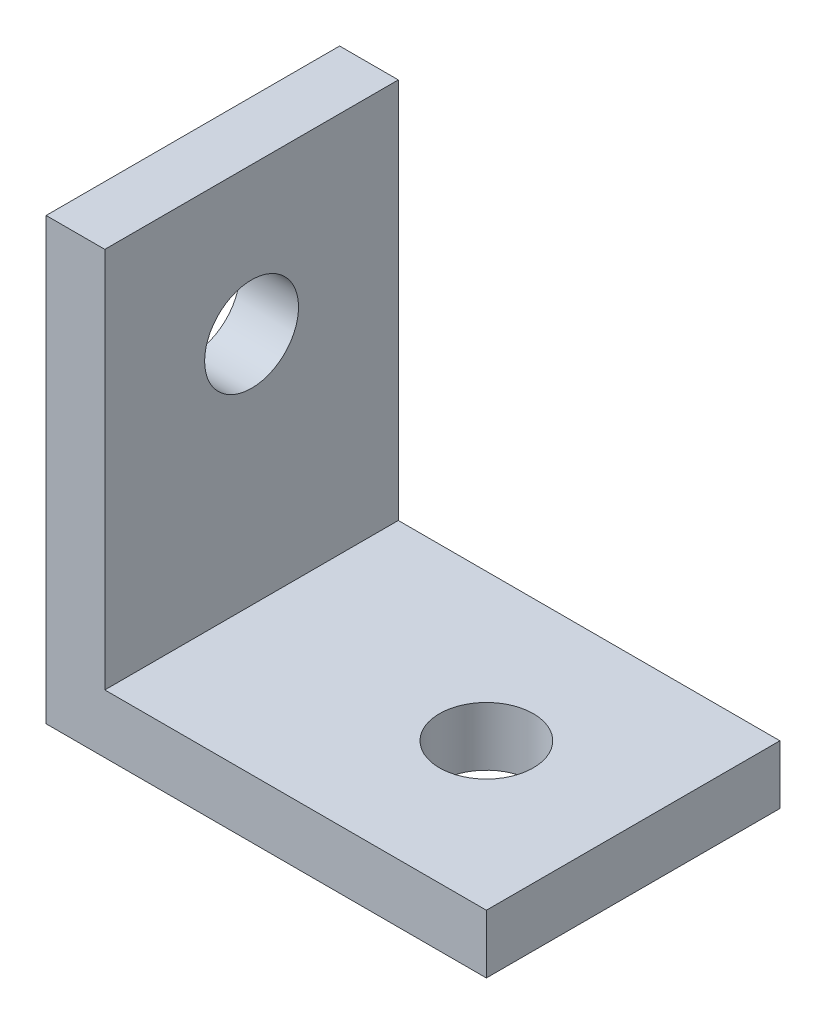
ISO-10303-21;
HEADER;
FILE_DESCRIPTION(('STEP AP214'),'2;1');
FILE_NAME('part.step','',(''),(''),'','','');
FILE_SCHEMA(('AUTOMOTIVE_DESIGN { 1 0 10303 214 1 1 1 1 }'));
ENDSEC;
DATA;
#1=APPLICATION_CONTEXT('core data for automotive mechanical design processes');
#2=APPLICATION_PROTOCOL_DEFINITION('international standard','automotive_design',2000,#1);
#3=PRODUCT_CONTEXT('',#1,'mechanical');
#4=PRODUCT('Part','Part','',(#3));
#5=PRODUCT_RELATED_PRODUCT_CATEGORY('part','',(#4));
#6=PRODUCT_DEFINITION_FORMATION('','',#4);
#7=PRODUCT_DEFINITION_CONTEXT('part definition',#1,'design');
#8=PRODUCT_DEFINITION('design','',#6,#7);
#9=PRODUCT_DEFINITION_SHAPE('','',#8);
#10=(LENGTH_UNIT() NAMED_UNIT(*) SI_UNIT(.MILLI.,.METRE.));
#11=(NAMED_UNIT(*) PLANE_ANGLE_UNIT() SI_UNIT($,.RADIAN.));
#12=(NAMED_UNIT(*) SI_UNIT($,.STERADIAN.) SOLID_ANGLE_UNIT());
#13=UNCERTAINTY_MEASURE_WITH_UNIT(LENGTH_MEASURE(1.E-05),#10,'distance_accuracy_value','');
#14=(GEOMETRIC_REPRESENTATION_CONTEXT(3) GLOBAL_UNCERTAINTY_ASSIGNED_CONTEXT((#13)) GLOBAL_UNIT_ASSIGNED_CONTEXT((#10,
#11,#12)) REPRESENTATION_CONTEXT('',''));
#15=CARTESIAN_POINT('',(0.,0.,0.));
#16=DIRECTION('',(0.,0.,1.));
#17=DIRECTION('',(1.,0.,0.));
#18=AXIS2_PLACEMENT_3D('',#15,#16,#17);
#19=CARTESIAN_POINT('',(15.,0.,5.));
#20=DIRECTION('',(0.,1.,0.));
#21=DIRECTION('',(-1.,0.,0.));
#22=AXIS2_PLACEMENT_3D('',#19,#20,#21);
#23=PLANE('',#22);
#24=CARTESIAN_POINT('',(10.,0.,0.));
#25=DIRECTION('',(0.,-1.,0.));
#26=DIRECTION('',(0.,0.,-1.));
#27=AXIS2_PLACEMENT_3D('',#24,#25,#26);
#28=CIRCLE('',#27,1.59999999999999);
#29=CARTESIAN_POINT('',(10.,0.,-1.59999999999999));
#30=VERTEX_POINT('',#29);
#31=EDGE_CURVE('E162',#30,#30,#28,.T.);
#32=ORIENTED_EDGE('',*,*,#31,.F.);
#33=EDGE_LOOP('',(#32));
#34=FACE_BOUND('',#33,.T.);
#35=DIRECTION('',(1.,0.,0.));
#36=VECTOR('',#35,1.);
#37=CARTESIAN_POINT('',(15.,0.,-5.));
#38=LINE('',#37,#36);
#39=CARTESIAN_POINT('',(0.,0.,-5.));
#40=VERTEX_POINT('',#39);
#41=CARTESIAN_POINT('',(15.,0.,-5.));
#42=VERTEX_POINT('',#41);
#43=EDGE_CURVE('E118',#40,#42,#38,.T.);
#44=ORIENTED_EDGE('',*,*,#43,.T.);
#45=DIRECTION('',(0.,0.,-1.));
#46=VECTOR('',#45,1.);
#47=CARTESIAN_POINT('',(15.,0.,5.));
#48=LINE('',#47,#46);
#49=CARTESIAN_POINT('',(15.,0.,5.));
#50=VERTEX_POINT('',#49);
#51=EDGE_CURVE('E11',#50,#42,#48,.T.);
#52=ORIENTED_EDGE('',*,*,#51,.F.);
#53=DIRECTION('',(1.,0.,0.));
#54=VECTOR('',#53,1.);
#55=CARTESIAN_POINT('',(15.,0.,5.));
#56=LINE('',#55,#54);
#57=CARTESIAN_POINT('',(0.,0.,5.));
#58=VERTEX_POINT('',#57);
#59=EDGE_CURVE('E129',#58,#50,#56,.T.);
#60=ORIENTED_EDGE('',*,*,#59,.F.);
#61=DIRECTION('',(0.,0.,-1.));
#62=VECTOR('',#61,1.);
#63=CARTESIAN_POINT('',(0.,0.,5.));
#64=LINE('',#63,#62);
#65=EDGE_CURVE('E114',#58,#40,#64,.T.);
#66=ORIENTED_EDGE('',*,*,#65,.T.);
#67=EDGE_LOOP('',(#44,#52,#60,#66));
#68=FACE_BOUND('',#67,.T.);
#69=ADVANCED_FACE('F34',(#34,#68),#23,.F.);
#70=CARTESIAN_POINT('',(15.,2.,5.));
#71=DIRECTION('',(-1.,0.,0.));
#72=DIRECTION('',(0.,0.,1.));
#73=AXIS2_PLACEMENT_3D('',#70,#71,#72);
#74=PLANE('',#73);
#75=DIRECTION('',(0.,1.,0.));
#76=VECTOR('',#75,1.);
#77=CARTESIAN_POINT('',(15.,2.,-5.));
#78=LINE('',#77,#76);
#79=CARTESIAN_POINT('',(15.,2.,-5.));
#80=VERTEX_POINT('',#79);
#81=EDGE_CURVE('E121',#42,#80,#78,.T.);
#82=ORIENTED_EDGE('',*,*,#81,.T.);
#83=DIRECTION('',(0.,0.,-1.));
#84=VECTOR('',#83,1.);
#85=CARTESIAN_POINT('',(15.,2.,5.));
#86=LINE('',#85,#84);
#87=CARTESIAN_POINT('',(15.,2.,5.));
#88=VERTEX_POINT('',#87);
#89=EDGE_CURVE('E42',#88,#80,#86,.T.);
#90=ORIENTED_EDGE('',*,*,#89,.F.);
#91=DIRECTION('',(0.,1.,0.));
#92=VECTOR('',#91,1.);
#93=CARTESIAN_POINT('',(15.,2.,5.));
#94=LINE('',#93,#92);
#95=EDGE_CURVE('E87',#50,#88,#94,.T.);
#96=ORIENTED_EDGE('',*,*,#95,.F.);
#97=ORIENTED_EDGE('',*,*,#51,.T.);
#98=EDGE_LOOP('',(#82,#90,#96,#97));
#99=FACE_BOUND('',#98,.T.);
#100=ADVANCED_FACE('F155',(#99),#74,.F.);
#101=CARTESIAN_POINT('',(2.,2.,5.));
#102=DIRECTION('',(0.,-1.,0.));
#103=DIRECTION('',(0.,0.,-1.));
#104=AXIS2_PLACEMENT_3D('',#101,#102,#103);
#105=PLANE('',#104);
#106=CARTESIAN_POINT('',(10.,2.,0.));
#107=DIRECTION('',(0.,-1.,0.));
#108=DIRECTION('',(0.,0.,-1.));
#109=AXIS2_PLACEMENT_3D('',#106,#107,#108);
#110=CIRCLE('',#109,1.59999999999999);
#111=CARTESIAN_POINT('',(10.,2.,-1.59999999999999));
#112=VERTEX_POINT('',#111);
#113=EDGE_CURVE('E122',#112,#112,#110,.T.);
#114=ORIENTED_EDGE('',*,*,#113,.T.);
#115=EDGE_LOOP('',(#114));
#116=FACE_BOUND('',#115,.T.);
#117=DIRECTION('',(-1.,0.,0.));
#118=VECTOR('',#117,1.);
#119=CARTESIAN_POINT('',(2.,2.,-5.));
#120=LINE('',#119,#118);
#121=CARTESIAN_POINT('',(2.,2.,-5.));
#122=VERTEX_POINT('',#121);
#123=EDGE_CURVE('E124',#80,#122,#120,.T.);
#124=ORIENTED_EDGE('',*,*,#123,.T.);
#125=DIRECTION('',(0.,0.,-1.));
#126=VECTOR('',#125,1.);
#127=CARTESIAN_POINT('',(2.,2.,5.));
#128=LINE('',#127,#126);
#129=CARTESIAN_POINT('',(2.,2.,5.));
#130=VERTEX_POINT('',#129);
#131=EDGE_CURVE('E109',#130,#122,#128,.T.);
#132=ORIENTED_EDGE('',*,*,#131,.F.);
#133=DIRECTION('',(-1.,0.,0.));
#134=VECTOR('',#133,1.);
#135=CARTESIAN_POINT('',(2.,2.,5.));
#136=LINE('',#135,#134);
#137=EDGE_CURVE('E100',#88,#130,#136,.T.);
#138=ORIENTED_EDGE('',*,*,#137,.F.);
#139=ORIENTED_EDGE('',*,*,#89,.T.);
#140=EDGE_LOOP('',(#124,#132,#138,#139));
#141=FACE_BOUND('',#140,.T.);
#142=ADVANCED_FACE('F135',(#116,#141),#105,.F.);
#143=CARTESIAN_POINT('',(2.,15.,5.));
#144=DIRECTION('',(-1.,0.,0.));
#145=DIRECTION('',(0.,-1.,0.));
#146=AXIS2_PLACEMENT_3D('',#143,#144,#145);
#147=PLANE('',#146);
#148=CARTESIAN_POINT('',(2.,10.,0.));
#149=DIRECTION('',(-1.,0.,0.));
#150=DIRECTION('',(0.,-1.,0.));
#151=AXIS2_PLACEMENT_3D('',#148,#149,#150);
#152=CIRCLE('',#151,1.59999999999999);
#153=CARTESIAN_POINT('',(2.,8.40000000000001,0.));
#154=VERTEX_POINT('',#153);
#155=EDGE_CURVE('E164',#154,#154,#152,.T.);
#156=ORIENTED_EDGE('',*,*,#155,.T.);
#157=EDGE_LOOP('',(#156));
#158=FACE_BOUND('',#157,.T.);
#159=DIRECTION('',(0.,1.,0.));
#160=VECTOR('',#159,1.);
#161=CARTESIAN_POINT('',(2.,15.,-5.));
#162=LINE('',#161,#160);
#163=CARTESIAN_POINT('',(2.,15.,-5.));
#164=VERTEX_POINT('',#163);
#165=EDGE_CURVE('E108',#122,#164,#162,.T.);
#166=ORIENTED_EDGE('',*,*,#165,.T.);
#167=DIRECTION('',(0.,0.,-1.));
#168=VECTOR('',#167,1.);
#169=CARTESIAN_POINT('',(2.,15.,5.));
#170=LINE('',#169,#168);
#171=CARTESIAN_POINT('',(2.,15.,5.));
#172=VERTEX_POINT('',#171);
#173=EDGE_CURVE('E105',#172,#164,#170,.T.);
#174=ORIENTED_EDGE('',*,*,#173,.F.);
#175=DIRECTION('',(0.,1.,0.));
#176=VECTOR('',#175,1.);
#177=CARTESIAN_POINT('',(2.,15.,5.));
#178=LINE('',#177,#176);
#179=EDGE_CURVE('E94',#130,#172,#178,.T.);
#180=ORIENTED_EDGE('',*,*,#179,.F.);
#181=ORIENTED_EDGE('',*,*,#131,.T.);
#182=EDGE_LOOP('',(#166,#174,#180,#181));
#183=FACE_BOUND('',#182,.T.);
#184=ADVANCED_FACE('F106',(#158,#183),#147,.F.);
#185=CARTESIAN_POINT('',(0.,15.,5.));
#186=DIRECTION('',(0.,-1.,0.));
#187=DIRECTION('',(0.,0.,-1.));
#188=AXIS2_PLACEMENT_3D('',#185,#186,#187);
#189=PLANE('',#188);
#190=DIRECTION('',(-1.,0.,0.));
#191=VECTOR('',#190,1.);
#192=CARTESIAN_POINT('',(0.,15.,-5.));
#193=LINE('',#192,#191);
#194=CARTESIAN_POINT('',(0.,15.,-5.));
#195=VERTEX_POINT('',#194);
#196=EDGE_CURVE('E73',#164,#195,#193,.T.);
#197=ORIENTED_EDGE('',*,*,#196,.T.);
#198=DIRECTION('',(0.,0.,-1.));
#199=VECTOR('',#198,1.);
#200=CARTESIAN_POINT('',(0.,15.,5.));
#201=LINE('',#200,#199);
#202=CARTESIAN_POINT('',(0.,15.,5.));
#203=VERTEX_POINT('',#202);
#204=EDGE_CURVE('E110',#203,#195,#201,.T.);
#205=ORIENTED_EDGE('',*,*,#204,.F.);
#206=DIRECTION('',(-1.,0.,0.));
#207=VECTOR('',#206,1.);
#208=CARTESIAN_POINT('',(0.,15.,5.));
#209=LINE('',#208,#207);
#210=EDGE_CURVE('E98',#172,#203,#209,.T.);
#211=ORIENTED_EDGE('',*,*,#210,.F.);
#212=ORIENTED_EDGE('',*,*,#173,.T.);
#213=EDGE_LOOP('',(#197,#205,#211,#212));
#214=FACE_BOUND('',#213,.T.);
#215=ADVANCED_FACE('F112',(#214),#189,.F.);
#216=CARTESIAN_POINT('',(0.,0.,5.));
#217=DIRECTION('',(1.,0.,0.));
#218=DIRECTION('',(0.,0.,-1.));
#219=AXIS2_PLACEMENT_3D('',#216,#217,#218);
#220=PLANE('',#219);
#221=CARTESIAN_POINT('',(0.,10.,0.));
#222=DIRECTION('',(-1.,0.,0.));
#223=DIRECTION('',(0.,0.,1.));
#224=AXIS2_PLACEMENT_3D('',#221,#222,#223);
#225=CIRCLE('',#224,1.59999999999999);
#226=CARTESIAN_POINT('',(0.,10.,1.59999999999999));
#227=VERTEX_POINT('',#226);
#228=EDGE_CURVE('E169',#227,#227,#225,.T.);
#229=ORIENTED_EDGE('',*,*,#228,.F.);
#230=EDGE_LOOP('',(#229));
#231=FACE_BOUND('',#230,.T.);
#232=DIRECTION('',(0.,-1.,0.));
#233=VECTOR('',#232,1.);
#234=CARTESIAN_POINT('',(0.,0.,-5.));
#235=LINE('',#234,#233);
#236=EDGE_CURVE('E79',#195,#40,#235,.T.);
#237=ORIENTED_EDGE('',*,*,#236,.T.);
#238=ORIENTED_EDGE('',*,*,#65,.F.);
#239=DIRECTION('',(0.,-1.,0.));
#240=VECTOR('',#239,1.);
#241=CARTESIAN_POINT('',(0.,0.,5.));
#242=LINE('',#241,#240);
#243=EDGE_CURVE('E50',#203,#58,#242,.T.);
#244=ORIENTED_EDGE('',*,*,#243,.F.);
#245=ORIENTED_EDGE('',*,*,#204,.T.);
#246=EDGE_LOOP('',(#237,#238,#244,#245));
#247=FACE_BOUND('',#246,.T.);
#248=ADVANCED_FACE('F142',(#231,#247),#220,.F.);
#249=CARTESIAN_POINT('',(0.,0.,5.));
#250=DIRECTION('',(0.,0.,-1.));
#251=DIRECTION('',(-1.,0.,0.));
#252=AXIS2_PLACEMENT_3D('',#249,#250,#251);
#253=PLANE('',#252);
#254=ORIENTED_EDGE('',*,*,#59,.T.);
#255=ORIENTED_EDGE('',*,*,#95,.T.);
#256=ORIENTED_EDGE('',*,*,#137,.T.);
#257=ORIENTED_EDGE('',*,*,#179,.T.);
#258=ORIENTED_EDGE('',*,*,#210,.T.);
#259=ORIENTED_EDGE('',*,*,#243,.T.);
#260=EDGE_LOOP('',(#254,#255,#256,#257,#258,#259));
#261=FACE_BOUND('',#260,.T.);
#262=ADVANCED_FACE('F96',(#261),#253,.F.);
#263=CARTESIAN_POINT('',(0.,0.,-5.));
#264=DIRECTION('',(0.,0.,-1.));
#265=DIRECTION('',(-1.,0.,0.));
#266=AXIS2_PLACEMENT_3D('',#263,#264,#265);
#267=PLANE('',#266);
#268=ORIENTED_EDGE('',*,*,#43,.F.);
#269=ORIENTED_EDGE('',*,*,#236,.F.);
#270=ORIENTED_EDGE('',*,*,#196,.F.);
#271=ORIENTED_EDGE('',*,*,#165,.F.);
#272=ORIENTED_EDGE('',*,*,#123,.F.);
#273=ORIENTED_EDGE('',*,*,#81,.F.);
#274=EDGE_LOOP('',(#268,#269,#270,#271,#272,#273));
#275=FACE_BOUND('',#274,.T.);
#276=ADVANCED_FACE('F138',(#275),#267,.T.);
#277=CARTESIAN_POINT('',(10.,0.,0.));
#278=DIRECTION('',(0.,-1.,0.));
#279=DIRECTION('',(0.,0.,-1.));
#280=AXIS2_PLACEMENT_3D('',#277,#278,#279);
#281=CYLINDRICAL_SURFACE('',#280,1.59999999999999);
#282=ORIENTED_EDGE('',*,*,#31,.T.);
#283=EDGE_LOOP('',(#282));
#284=FACE_BOUND('',#283,.T.);
#285=ORIENTED_EDGE('',*,*,#113,.F.);
#286=EDGE_LOOP('',(#285));
#287=FACE_BOUND('',#286,.T.);
#288=ADVANCED_FACE('F179',(#284,#287),#281,.F.);
#289=CARTESIAN_POINT('',(0.,10.,0.));
#290=DIRECTION('',(-1.,0.,0.));
#291=DIRECTION('',(0.,0.,1.));
#292=AXIS2_PLACEMENT_3D('',#289,#290,#291);
#293=CYLINDRICAL_SURFACE('',#292,1.59999999999999);
#294=ORIENTED_EDGE('',*,*,#228,.T.);
#295=EDGE_LOOP('',(#294));
#296=FACE_BOUND('',#295,.T.);
#297=ORIENTED_EDGE('',*,*,#155,.F.);
#298=EDGE_LOOP('',(#297));
#299=FACE_BOUND('',#298,.T.);
#300=ADVANCED_FACE('F176',(#296,#299),#293,.F.);
#301=CLOSED_SHELL('',(#69,#100,#142,#184,#215,#248,#262,#276,#288,#300));
#302=MANIFOLD_SOLID_BREP('B2',#301);
#303=ADVANCED_BREP_SHAPE_REPRESENTATION('',(#18,#302),#14);
#304=SHAPE_DEFINITION_REPRESENTATION(#9,#303);
ENDSEC;
END-ISO-10303-21;
